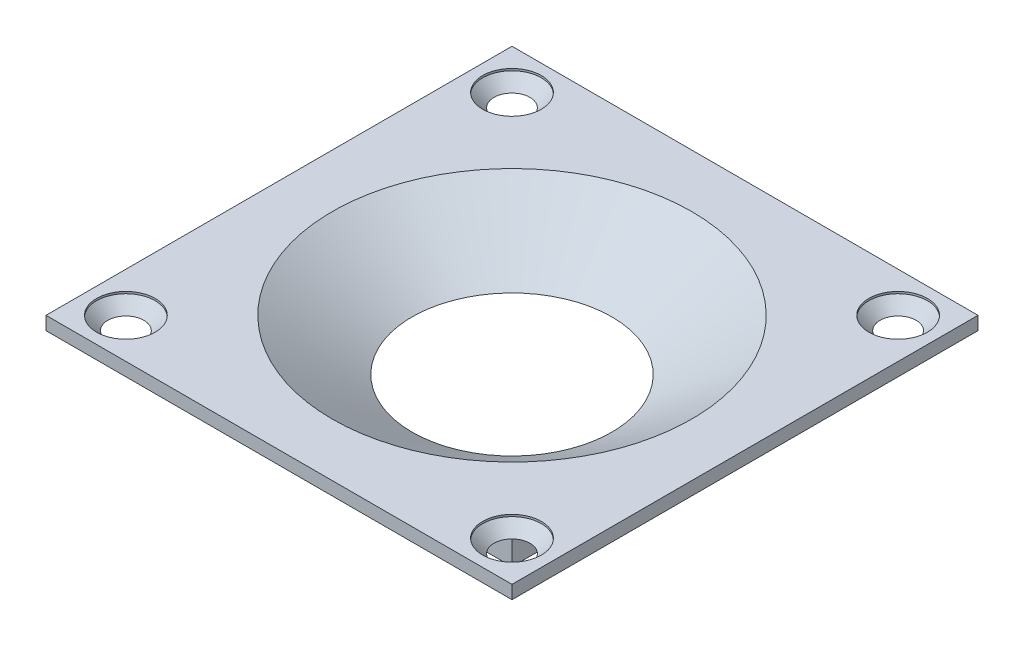
ISO-10303-21;
HEADER;
FILE_DESCRIPTION(('STEP AP214'),'2;1');
FILE_NAME('part.step','',(''),(''),'','','');
FILE_SCHEMA(('AUTOMOTIVE_DESIGN { 1 0 10303 214 1 1 1 1 }'));
ENDSEC;
DATA;
#1=APPLICATION_CONTEXT('core data for automotive mechanical design processes');
#2=APPLICATION_PROTOCOL_DEFINITION('international standard','automotive_design',2000,#1);
#3=PRODUCT_CONTEXT('',#1,'mechanical');
#4=PRODUCT('Part','Part','',(#3));
#5=PRODUCT_RELATED_PRODUCT_CATEGORY('part','',(#4));
#6=PRODUCT_DEFINITION_FORMATION('','',#4);
#7=PRODUCT_DEFINITION_CONTEXT('part definition',#1,'design');
#8=PRODUCT_DEFINITION('design','',#6,#7);
#9=PRODUCT_DEFINITION_SHAPE('','',#8);
#10=(LENGTH_UNIT() NAMED_UNIT(*) SI_UNIT(.MILLI.,.METRE.));
#11=(NAMED_UNIT(*) PLANE_ANGLE_UNIT() SI_UNIT($,.RADIAN.));
#12=(NAMED_UNIT(*) SI_UNIT($,.STERADIAN.) SOLID_ANGLE_UNIT());
#13=UNCERTAINTY_MEASURE_WITH_UNIT(LENGTH_MEASURE(1.E-05),#10,'distance_accuracy_value','');
#14=(GEOMETRIC_REPRESENTATION_CONTEXT(3) GLOBAL_UNCERTAINTY_ASSIGNED_CONTEXT((#13)) GLOBAL_UNIT_ASSIGNED_CONTEXT((#10,
#11,#12)) REPRESENTATION_CONTEXT('',''));
#15=CARTESIAN_POINT('',(0.,0.,0.));
#16=DIRECTION('',(0.,0.,1.));
#17=DIRECTION('',(1.,0.,0.));
#18=AXIS2_PLACEMENT_3D('',#15,#16,#17);
#19=CARTESIAN_POINT('',(12.5,2.85,12.5));
#20=DIRECTION('',(-1.,0.,0.));
#21=DIRECTION('',(0.,0.,1.));
#22=AXIS2_PLACEMENT_3D('',#19,#20,#21);
#23=PLANE('',#22);
#24=DIRECTION('',(0.,0.,-1.));
#25=VECTOR('',#24,1.);
#26=CARTESIAN_POINT('',(12.5,0.,12.5));
#27=LINE('',#26,#25);
#28=CARTESIAN_POINT('',(12.5,0.,12.5));
#29=VERTEX_POINT('',#28);
#30=CARTESIAN_POINT('',(12.5,0.,-12.5));
#31=VERTEX_POINT('',#30);
#32=EDGE_CURVE('E134',#29,#31,#27,.T.);
#33=ORIENTED_EDGE('',*,*,#32,.T.);
#34=DIRECTION('',(0.,-1.,0.));
#35=VECTOR('',#34,1.);
#36=CARTESIAN_POINT('',(12.5,2.85,-12.5));
#37=LINE('',#36,#35);
#38=CARTESIAN_POINT('',(12.5,2.85,-12.5));
#39=VERTEX_POINT('',#38);
#40=EDGE_CURVE('E11',#39,#31,#37,.T.);
#41=ORIENTED_EDGE('',*,*,#40,.F.);
#42=DIRECTION('',(0.,0.,-1.));
#43=VECTOR('',#42,1.);
#44=CARTESIAN_POINT('',(12.5,2.85,12.5));
#45=LINE('',#44,#43);
#46=CARTESIAN_POINT('',(12.5,2.85,12.5));
#47=VERTEX_POINT('',#46);
#48=EDGE_CURVE('E143',#47,#39,#45,.T.);
#49=ORIENTED_EDGE('',*,*,#48,.F.);
#50=DIRECTION('',(0.,-1.,0.));
#51=VECTOR('',#50,1.);
#52=CARTESIAN_POINT('',(12.5,2.85,12.5));
#53=LINE('',#52,#51);
#54=EDGE_CURVE('E152',#47,#29,#53,.T.);
#55=ORIENTED_EDGE('',*,*,#54,.T.);
#56=EDGE_LOOP('',(#33,#41,#49,#55));
#57=FACE_BOUND('',#56,.T.);
#58=ADVANCED_FACE('F34',(#57),#23,.F.);
#59=CARTESIAN_POINT('',(-12.5,2.85,-12.5));
#60=DIRECTION('',(0.,0.,1.));
#61=DIRECTION('',(1.,0.,0.));
#62=AXIS2_PLACEMENT_3D('',#59,#60,#61);
#63=PLANE('',#62);
#64=DIRECTION('',(-1.,0.,0.));
#65=VECTOR('',#64,1.);
#66=CARTESIAN_POINT('',(-12.5,0.,-12.5));
#67=LINE('',#66,#65);
#68=CARTESIAN_POINT('',(-12.5,0.,-12.5));
#69=VERTEX_POINT('',#68);
#70=EDGE_CURVE('E137',#31,#69,#67,.T.);
#71=ORIENTED_EDGE('',*,*,#70,.T.);
#72=DIRECTION('',(0.,-1.,0.));
#73=VECTOR('',#72,1.);
#74=CARTESIAN_POINT('',(-12.5,2.85,-12.5));
#75=LINE('',#74,#73);
#76=CARTESIAN_POINT('',(-12.5,2.85,-12.5));
#77=VERTEX_POINT('',#76);
#78=EDGE_CURVE('E43',#77,#69,#75,.T.);
#79=ORIENTED_EDGE('',*,*,#78,.F.);
#80=DIRECTION('',(-1.,0.,0.));
#81=VECTOR('',#80,1.);
#82=CARTESIAN_POINT('',(-12.5,2.85,-12.5));
#83=LINE('',#82,#81);
#84=EDGE_CURVE('E78',#39,#77,#83,.T.);
#85=ORIENTED_EDGE('',*,*,#84,.F.);
#86=ORIENTED_EDGE('',*,*,#40,.T.);
#87=EDGE_LOOP('',(#71,#79,#85,#86));
#88=FACE_BOUND('',#87,.T.);
#89=ADVANCED_FACE('F226',(#88),#63,.F.);
#90=CARTESIAN_POINT('',(-12.5,2.85,12.5));
#91=DIRECTION('',(1.,0.,0.));
#92=DIRECTION('',(0.,0.,-1.));
#93=AXIS2_PLACEMENT_3D('',#90,#91,#92);
#94=PLANE('',#93);
#95=DIRECTION('',(0.,0.,1.));
#96=VECTOR('',#95,1.);
#97=CARTESIAN_POINT('',(-12.5,0.,12.5));
#98=LINE('',#97,#96);
#99=CARTESIAN_POINT('',(-12.5,0.,12.5));
#100=VERTEX_POINT('',#99);
#101=EDGE_CURVE('E68',#69,#100,#98,.T.);
#102=ORIENTED_EDGE('',*,*,#101,.T.);
#103=DIRECTION('',(0.,-1.,0.));
#104=VECTOR('',#103,1.);
#105=CARTESIAN_POINT('',(-12.5,2.85,12.5));
#106=LINE('',#105,#104);
#107=CARTESIAN_POINT('',(-12.5,2.85,12.5));
#108=VERTEX_POINT('',#107);
#109=EDGE_CURVE('E52',#108,#100,#106,.T.);
#110=ORIENTED_EDGE('',*,*,#109,.F.);
#111=DIRECTION('',(0.,0.,1.));
#112=VECTOR('',#111,1.);
#113=CARTESIAN_POINT('',(-12.5,2.85,12.5));
#114=LINE('',#113,#112);
#115=EDGE_CURVE('E147',#77,#108,#114,.T.);
#116=ORIENTED_EDGE('',*,*,#115,.F.);
#117=ORIENTED_EDGE('',*,*,#78,.T.);
#118=EDGE_LOOP('',(#102,#110,#116,#117));
#119=FACE_BOUND('',#118,.T.);
#120=ADVANCED_FACE('F231',(#119),#94,.F.);
#121=CARTESIAN_POINT('',(-12.5,2.85,12.5));
#122=DIRECTION('',(0.,0.,-1.));
#123=DIRECTION('',(-1.,0.,0.));
#124=AXIS2_PLACEMENT_3D('',#121,#122,#123);
#125=PLANE('',#124);
#126=DIRECTION('',(1.,0.,0.));
#127=VECTOR('',#126,1.);
#128=CARTESIAN_POINT('',(-12.5,0.,12.5));
#129=LINE('',#128,#127);
#130=EDGE_CURVE('E73',#100,#29,#129,.T.);
#131=ORIENTED_EDGE('',*,*,#130,.T.);
#132=ORIENTED_EDGE('',*,*,#54,.F.);
#133=DIRECTION('',(1.,0.,0.));
#134=VECTOR('',#133,1.);
#135=CARTESIAN_POINT('',(-12.5,2.85,12.5));
#136=LINE('',#135,#134);
#137=EDGE_CURVE('E150',#108,#47,#136,.T.);
#138=ORIENTED_EDGE('',*,*,#137,.F.);
#139=ORIENTED_EDGE('',*,*,#109,.T.);
#140=EDGE_LOOP('',(#131,#132,#138,#139));
#141=FACE_BOUND('',#140,.T.);
#142=ADVANCED_FACE('F235',(#141),#125,.F.);
#143=CARTESIAN_POINT('',(0.,0.,0.));
#144=DIRECTION('',(0.,-1.,0.));
#145=DIRECTION('',(0.,0.,-1.));
#146=AXIS2_PLACEMENT_3D('',#143,#144,#145);
#147=PLANE('',#146);
#148=CARTESIAN_POINT('',(0.,0.,0.));
#149=DIRECTION('',(0.,-1.,0.));
#150=DIRECTION('',(0.,0.,-1.));
#151=AXIS2_PLACEMENT_3D('',#148,#149,#150);
#152=CIRCLE('',#151,7.5);
#153=CARTESIAN_POINT('',(0.,0.,-7.5));
#154=VERTEX_POINT('',#153);
#155=EDGE_CURVE('E194',#154,#154,#152,.T.);
#156=ORIENTED_EDGE('',*,*,#155,.F.);
#157=EDGE_LOOP('',(#156));
#158=FACE_BOUND('',#157,.T.);
#159=ORIENTED_EDGE('',*,*,#32,.F.);
#160=ORIENTED_EDGE('',*,*,#130,.F.);
#161=ORIENTED_EDGE('',*,*,#101,.F.);
#162=ORIENTED_EDGE('',*,*,#70,.F.);
#163=EDGE_LOOP('',(#159,#160,#161,#162));
#164=FACE_BOUND('',#163,.T.);
#165=ADVANCED_FACE('F234',(#158,#164),#147,.T.);
#166=CARTESIAN_POINT('',(0.,2.85,0.));
#167=DIRECTION('',(0.,-1.,0.));
#168=DIRECTION('',(0.,0.,-1.));
#169=AXIS2_PLACEMENT_3D('',#166,#167,#168);
#170=PLANE('',#169);
#171=CARTESIAN_POINT('',(-14.5,2.85,-14.5));
#172=DIRECTION('',(0.,-1.,0.));
#173=DIRECTION('',(0.,0.,-1.));
#174=AXIS2_PLACEMENT_3D('',#171,#172,#173);
#175=CIRCLE('',#174,1.35);
#176=CARTESIAN_POINT('',(-14.5,2.85,-15.85));
#177=VERTEX_POINT('',#176);
#178=EDGE_CURVE('E37',#177,#177,#175,.T.);
#179=ORIENTED_EDGE('',*,*,#178,.F.);
#180=EDGE_LOOP('',(#179));
#181=FACE_BOUND('',#180,.T.);
#182=CARTESIAN_POINT('',(14.5,2.85,-14.5));
#183=DIRECTION('',(0.,-1.,0.));
#184=DIRECTION('',(0.,0.,-1.));
#185=AXIS2_PLACEMENT_3D('',#182,#183,#184);
#186=CIRCLE('',#185,1.35);
#187=CARTESIAN_POINT('',(14.5,2.85,-15.85));
#188=VERTEX_POINT('',#187);
#189=EDGE_CURVE('E169',#188,#188,#186,.T.);
#190=ORIENTED_EDGE('',*,*,#189,.F.);
#191=EDGE_LOOP('',(#190));
#192=FACE_BOUND('',#191,.T.);
#193=CARTESIAN_POINT('',(14.5,2.85,14.5));
#194=DIRECTION('',(0.,-1.,0.));
#195=DIRECTION('',(0.,0.,-1.));
#196=AXIS2_PLACEMENT_3D('',#193,#194,#195);
#197=CIRCLE('',#196,1.35);
#198=CARTESIAN_POINT('',(14.5,2.85,13.15));
#199=VERTEX_POINT('',#198);
#200=EDGE_CURVE('E165',#199,#199,#197,.T.);
#201=ORIENTED_EDGE('',*,*,#200,.F.);
#202=EDGE_LOOP('',(#201));
#203=FACE_BOUND('',#202,.T.);
#204=CARTESIAN_POINT('',(-14.5,2.85,14.5));
#205=DIRECTION('',(0.,-1.,0.));
#206=DIRECTION('',(0.,0.,-1.));
#207=AXIS2_PLACEMENT_3D('',#204,#205,#206);
#208=CIRCLE('',#207,1.35);
#209=CARTESIAN_POINT('',(-14.5,2.85,13.15));
#210=VERTEX_POINT('',#209);
#211=EDGE_CURVE('E160',#210,#210,#208,.T.);
#212=ORIENTED_EDGE('',*,*,#211,.F.);
#213=EDGE_LOOP('',(#212));
#214=FACE_BOUND('',#213,.T.);
#215=DIRECTION('',(0.,0.,-1.));
#216=VECTOR('',#215,1.);
#217=CARTESIAN_POINT('',(17.5,2.85,17.5));
#218=LINE('',#217,#216);
#219=CARTESIAN_POINT('',(17.5,2.85,17.5));
#220=VERTEX_POINT('',#219);
#221=CARTESIAN_POINT('',(17.5,2.85,-17.5));
#222=VERTEX_POINT('',#221);
#223=EDGE_CURVE('E133',#220,#222,#218,.T.);
#224=ORIENTED_EDGE('',*,*,#223,.F.);
#225=DIRECTION('',(1.,0.,0.));
#226=VECTOR('',#225,1.);
#227=CARTESIAN_POINT('',(-17.5,2.85,17.5));
#228=LINE('',#227,#226);
#229=CARTESIAN_POINT('',(-17.5,2.85,17.5));
#230=VERTEX_POINT('',#229);
#231=EDGE_CURVE('E129',#230,#220,#228,.T.);
#232=ORIENTED_EDGE('',*,*,#231,.F.);
#233=DIRECTION('',(0.,0.,1.));
#234=VECTOR('',#233,1.);
#235=CARTESIAN_POINT('',(-17.5,2.85,17.5));
#236=LINE('',#235,#234);
#237=CARTESIAN_POINT('',(-17.5,2.85,-17.5));
#238=VERTEX_POINT('',#237);
#239=EDGE_CURVE('E203',#238,#230,#236,.T.);
#240=ORIENTED_EDGE('',*,*,#239,.F.);
#241=DIRECTION('',(-1.,0.,0.));
#242=VECTOR('',#241,1.);
#243=CARTESIAN_POINT('',(-17.5,2.85,-17.5));
#244=LINE('',#243,#242);
#245=EDGE_CURVE('E201',#222,#238,#244,.T.);
#246=ORIENTED_EDGE('',*,*,#245,.F.);
#247=EDGE_LOOP('',(#224,#232,#240,#246));
#248=FACE_BOUND('',#247,.T.);
#249=ORIENTED_EDGE('',*,*,#48,.T.);
#250=ORIENTED_EDGE('',*,*,#84,.T.);
#251=ORIENTED_EDGE('',*,*,#115,.T.);
#252=ORIENTED_EDGE('',*,*,#137,.T.);
#253=EDGE_LOOP('',(#249,#250,#251,#252));
#254=FACE_BOUND('',#253,.T.);
#255=ADVANCED_FACE('F214',(#181,#192,#203,#214,#248,#254),#170,.T.);
#256=CARTESIAN_POINT('',(17.5,3.85,17.5));
#257=DIRECTION('',(-1.,0.,0.));
#258=DIRECTION('',(0.,0.,1.));
#259=AXIS2_PLACEMENT_3D('',#256,#257,#258);
#260=PLANE('',#259);
#261=ORIENTED_EDGE('',*,*,#223,.T.);
#262=DIRECTION('',(0.,-1.,0.));
#263=VECTOR('',#262,1.);
#264=CARTESIAN_POINT('',(17.5,3.85,-17.5));
#265=LINE('',#264,#263);
#266=CARTESIAN_POINT('',(17.5,3.85,-17.5));
#267=VERTEX_POINT('',#266);
#268=EDGE_CURVE('E113',#267,#222,#265,.T.);
#269=ORIENTED_EDGE('',*,*,#268,.F.);
#270=DIRECTION('',(0.,0.,-1.));
#271=VECTOR('',#270,1.);
#272=CARTESIAN_POINT('',(17.5,3.85,17.5));
#273=LINE('',#272,#271);
#274=CARTESIAN_POINT('',(17.5,3.85,17.5));
#275=VERTEX_POINT('',#274);
#276=EDGE_CURVE('E120',#275,#267,#273,.T.);
#277=ORIENTED_EDGE('',*,*,#276,.F.);
#278=DIRECTION('',(0.,-1.,0.));
#279=VECTOR('',#278,1.);
#280=CARTESIAN_POINT('',(17.5,3.85,17.5));
#281=LINE('',#280,#279);
#282=EDGE_CURVE('E199',#275,#220,#281,.T.);
#283=ORIENTED_EDGE('',*,*,#282,.T.);
#284=EDGE_LOOP('',(#261,#269,#277,#283));
#285=FACE_BOUND('',#284,.T.);
#286=ADVANCED_FACE('F131',(#285),#260,.F.);
#287=CARTESIAN_POINT('',(-17.5,3.85,-17.5));
#288=DIRECTION('',(0.,0.,1.));
#289=DIRECTION('',(1.,0.,0.));
#290=AXIS2_PLACEMENT_3D('',#287,#288,#289);
#291=PLANE('',#290);
#292=ORIENTED_EDGE('',*,*,#245,.T.);
#293=DIRECTION('',(0.,-1.,0.));
#294=VECTOR('',#293,1.);
#295=CARTESIAN_POINT('',(-17.5,3.85,-17.5));
#296=LINE('',#295,#294);
#297=CARTESIAN_POINT('',(-17.5,3.85,-17.5));
#298=VERTEX_POINT('',#297);
#299=EDGE_CURVE('E116',#298,#238,#296,.T.);
#300=ORIENTED_EDGE('',*,*,#299,.F.);
#301=DIRECTION('',(-1.,0.,0.));
#302=VECTOR('',#301,1.);
#303=CARTESIAN_POINT('',(-17.5,3.85,-17.5));
#304=LINE('',#303,#302);
#305=EDGE_CURVE('E109',#267,#298,#304,.T.);
#306=ORIENTED_EDGE('',*,*,#305,.F.);
#307=ORIENTED_EDGE('',*,*,#268,.T.);
#308=EDGE_LOOP('',(#292,#300,#306,#307));
#309=FACE_BOUND('',#308,.T.);
#310=ADVANCED_FACE('F111',(#309),#291,.F.);
#311=CARTESIAN_POINT('',(-17.5,3.85,17.5));
#312=DIRECTION('',(1.,0.,0.));
#313=DIRECTION('',(0.,0.,-1.));
#314=AXIS2_PLACEMENT_3D('',#311,#312,#313);
#315=PLANE('',#314);
#316=ORIENTED_EDGE('',*,*,#239,.T.);
#317=DIRECTION('',(0.,-1.,0.));
#318=VECTOR('',#317,1.);
#319=CARTESIAN_POINT('',(-17.5,3.85,17.5));
#320=LINE('',#319,#318);
#321=CARTESIAN_POINT('',(-17.5,3.85,17.5));
#322=VERTEX_POINT('',#321);
#323=EDGE_CURVE('E139',#322,#230,#320,.T.);
#324=ORIENTED_EDGE('',*,*,#323,.F.);
#325=DIRECTION('',(0.,0.,1.));
#326=VECTOR('',#325,1.);
#327=CARTESIAN_POINT('',(-17.5,3.85,17.5));
#328=LINE('',#327,#326);
#329=EDGE_CURVE('E119',#298,#322,#328,.T.);
#330=ORIENTED_EDGE('',*,*,#329,.F.);
#331=ORIENTED_EDGE('',*,*,#299,.T.);
#332=EDGE_LOOP('',(#316,#324,#330,#331));
#333=FACE_BOUND('',#332,.T.);
#334=ADVANCED_FACE('F216',(#333),#315,.F.);
#335=CARTESIAN_POINT('',(-17.5,3.85,17.5));
#336=DIRECTION('',(0.,0.,-1.));
#337=DIRECTION('',(-1.,0.,0.));
#338=AXIS2_PLACEMENT_3D('',#335,#336,#337);
#339=PLANE('',#338);
#340=ORIENTED_EDGE('',*,*,#231,.T.);
#341=ORIENTED_EDGE('',*,*,#282,.F.);
#342=DIRECTION('',(1.,0.,0.));
#343=VECTOR('',#342,1.);
#344=CARTESIAN_POINT('',(-17.5,3.85,17.5));
#345=LINE('',#344,#343);
#346=EDGE_CURVE('E125',#322,#275,#345,.T.);
#347=ORIENTED_EDGE('',*,*,#346,.F.);
#348=ORIENTED_EDGE('',*,*,#323,.T.);
#349=EDGE_LOOP('',(#340,#341,#347,#348));
#350=FACE_BOUND('',#349,.T.);
#351=ADVANCED_FACE('F210',(#350),#339,.F.);
#352=CARTESIAN_POINT('',(0.,3.85,0.));
#353=DIRECTION('',(0.,-1.,0.));
#354=DIRECTION('',(0.,0.,-1.));
#355=AXIS2_PLACEMENT_3D('',#352,#353,#354);
#356=PLANE('',#355);
#357=CARTESIAN_POINT('',(-14.5,3.85,-14.5));
#358=DIRECTION('',(0.,1.,0.));
#359=DIRECTION('',(0.,0.,1.));
#360=AXIS2_PLACEMENT_3D('',#357,#358,#359);
#361=CIRCLE('',#360,2.2);
#362=CARTESIAN_POINT('',(-14.5,3.85,-12.3));
#363=VERTEX_POINT('',#362);
#364=EDGE_CURVE('E303',#363,#363,#361,.T.);
#365=ORIENTED_EDGE('',*,*,#364,.F.);
#366=EDGE_LOOP('',(#365));
#367=FACE_BOUND('',#366,.T.);
#368=CARTESIAN_POINT('',(14.5,3.85,-14.5));
#369=DIRECTION('',(0.,1.,0.));
#370=DIRECTION('',(0.,0.,1.));
#371=AXIS2_PLACEMENT_3D('',#368,#369,#370);
#372=CIRCLE('',#371,2.2);
#373=CARTESIAN_POINT('',(14.5,3.85,-12.3));
#374=VERTEX_POINT('',#373);
#375=EDGE_CURVE('E178',#374,#374,#372,.T.);
#376=ORIENTED_EDGE('',*,*,#375,.F.);
#377=EDGE_LOOP('',(#376));
#378=FACE_BOUND('',#377,.T.);
#379=CARTESIAN_POINT('',(14.5,3.85,14.5));
#380=DIRECTION('',(0.,1.,0.));
#381=DIRECTION('',(0.,0.,1.));
#382=AXIS2_PLACEMENT_3D('',#379,#380,#381);
#383=CIRCLE('',#382,2.2);
#384=CARTESIAN_POINT('',(14.5,3.85,16.7));
#385=VERTEX_POINT('',#384);
#386=EDGE_CURVE('E171',#385,#385,#383,.T.);
#387=ORIENTED_EDGE('',*,*,#386,.F.);
#388=EDGE_LOOP('',(#387));
#389=FACE_BOUND('',#388,.T.);
#390=CARTESIAN_POINT('',(-14.5,3.85,14.5));
#391=DIRECTION('',(0.,1.,0.));
#392=DIRECTION('',(0.,0.,1.));
#393=AXIS2_PLACEMENT_3D('',#390,#391,#392);
#394=CIRCLE('',#393,2.2);
#395=CARTESIAN_POINT('',(-14.5,3.85,16.7));
#396=VERTEX_POINT('',#395);
#397=EDGE_CURVE('E167',#396,#396,#394,.T.);
#398=ORIENTED_EDGE('',*,*,#397,.F.);
#399=EDGE_LOOP('',(#398));
#400=FACE_BOUND('',#399,.T.);
#401=CARTESIAN_POINT('',(0.,3.85,0.));
#402=DIRECTION('',(0.,-1.,0.));
#403=DIRECTION('',(0.,0.,-1.));
#404=AXIS2_PLACEMENT_3D('',#401,#402,#403);
#405=CIRCLE('',#404,13.5);
#406=CARTESIAN_POINT('',(0.,3.85,-13.5));
#407=VERTEX_POINT('',#406);
#408=EDGE_CURVE('E163',#407,#407,#405,.T.);
#409=ORIENTED_EDGE('',*,*,#408,.T.);
#410=EDGE_LOOP('',(#409));
#411=FACE_BOUND('',#410,.T.);
#412=ORIENTED_EDGE('',*,*,#276,.T.);
#413=ORIENTED_EDGE('',*,*,#305,.T.);
#414=ORIENTED_EDGE('',*,*,#329,.T.);
#415=ORIENTED_EDGE('',*,*,#346,.T.);
#416=EDGE_LOOP('',(#412,#413,#414,#415));
#417=FACE_BOUND('',#416,.T.);
#418=ADVANCED_FACE('F123',(#367,#378,#389,#400,#411,#417),#356,.F.);
#419=CARTESIAN_POINT('',(0.,0.,0.));
#420=DIRECTION('',(0.,1.,0.));
#421=DIRECTION('',(0.,0.,1.));
#422=AXIS2_PLACEMENT_3D('',#419,#420,#421);
#423=CONICAL_SURFACE('',#422,7.5,1.00030166176382);
#424=ORIENTED_EDGE('',*,*,#408,.F.);
#425=EDGE_LOOP('',(#424));
#426=FACE_BOUND('',#425,.T.);
#427=ORIENTED_EDGE('',*,*,#155,.T.);
#428=EDGE_LOOP('',(#427));
#429=FACE_BOUND('',#428,.T.);
#430=ADVANCED_FACE('F260',(#426,#429),#423,.F.);
#431=CARTESIAN_POINT('',(-14.5,3.7,14.5));
#432=DIRECTION('',(0.,1.,0.));
#433=DIRECTION('',(0.,0.,1.));
#434=AXIS2_PLACEMENT_3D('',#431,#432,#433);
#435=CONICAL_SURFACE('',#434,2.2,0.785398163397448);
#436=ORIENTED_EDGE('',*,*,#211,.T.);
#437=EDGE_LOOP('',(#436));
#438=FACE_BOUND('',#437,.T.);
#439=CARTESIAN_POINT('',(-14.5,3.7,14.5));
#440=DIRECTION('',(0.,1.,0.));
#441=DIRECTION('',(0.,0.,1.));
#442=AXIS2_PLACEMENT_3D('',#439,#440,#441);
#443=CIRCLE('',#442,2.2);
#444=CARTESIAN_POINT('',(-14.5,3.7,16.7));
#445=VERTEX_POINT('',#444);
#446=EDGE_CURVE('E164',#445,#445,#443,.T.);
#447=ORIENTED_EDGE('',*,*,#446,.T.);
#448=EDGE_LOOP('',(#447));
#449=FACE_BOUND('',#448,.T.);
#450=ADVANCED_FACE('F264',(#438,#449),#435,.F.);
#451=CARTESIAN_POINT('',(-14.5,3.85,14.5));
#452=DIRECTION('',(0.,1.,0.));
#453=DIRECTION('',(0.,0.,1.));
#454=AXIS2_PLACEMENT_3D('',#451,#452,#453);
#455=CYLINDRICAL_SURFACE('',#454,2.2);
#456=ORIENTED_EDGE('',*,*,#446,.F.);
#457=EDGE_LOOP('',(#456));
#458=FACE_BOUND('',#457,.T.);
#459=ORIENTED_EDGE('',*,*,#397,.T.);
#460=EDGE_LOOP('',(#459));
#461=FACE_BOUND('',#460,.T.);
#462=ADVANCED_FACE('F268',(#458,#461),#455,.F.);
#463=CARTESIAN_POINT('',(14.5,3.7,14.5));
#464=DIRECTION('',(0.,1.,0.));
#465=DIRECTION('',(0.,0.,1.));
#466=AXIS2_PLACEMENT_3D('',#463,#464,#465);
#467=CONICAL_SURFACE('',#466,2.2,0.785398163397449);
#468=ORIENTED_EDGE('',*,*,#200,.T.);
#469=EDGE_LOOP('',(#468));
#470=FACE_BOUND('',#469,.T.);
#471=CARTESIAN_POINT('',(14.5,3.7,14.5));
#472=DIRECTION('',(0.,1.,0.));
#473=DIRECTION('',(0.,0.,1.));
#474=AXIS2_PLACEMENT_3D('',#471,#472,#473);
#475=CIRCLE('',#474,2.2);
#476=CARTESIAN_POINT('',(14.5,3.7,16.7));
#477=VERTEX_POINT('',#476);
#478=EDGE_CURVE('E168',#477,#477,#475,.T.);
#479=ORIENTED_EDGE('',*,*,#478,.T.);
#480=EDGE_LOOP('',(#479));
#481=FACE_BOUND('',#480,.T.);
#482=ADVANCED_FACE('F272',(#470,#481),#467,.F.);
#483=CARTESIAN_POINT('',(14.5,3.85,14.5));
#484=DIRECTION('',(0.,1.,0.));
#485=DIRECTION('',(0.,0.,1.));
#486=AXIS2_PLACEMENT_3D('',#483,#484,#485);
#487=CYLINDRICAL_SURFACE('',#486,2.2);
#488=ORIENTED_EDGE('',*,*,#478,.F.);
#489=EDGE_LOOP('',(#488));
#490=FACE_BOUND('',#489,.T.);
#491=ORIENTED_EDGE('',*,*,#386,.T.);
#492=EDGE_LOOP('',(#491));
#493=FACE_BOUND('',#492,.T.);
#494=ADVANCED_FACE('F276',(#490,#493),#487,.F.);
#495=CARTESIAN_POINT('',(14.5,3.7,-14.5));
#496=DIRECTION('',(0.,1.,0.));
#497=DIRECTION('',(0.,0.,1.));
#498=AXIS2_PLACEMENT_3D('',#495,#496,#497);
#499=CONICAL_SURFACE('',#498,2.2,0.785398163397447);
#500=ORIENTED_EDGE('',*,*,#189,.T.);
#501=EDGE_LOOP('',(#500));
#502=FACE_BOUND('',#501,.T.);
#503=CARTESIAN_POINT('',(14.5,3.7,-14.5));
#504=DIRECTION('',(0.,1.,0.));
#505=DIRECTION('',(0.,0.,1.));
#506=AXIS2_PLACEMENT_3D('',#503,#504,#505);
#507=CIRCLE('',#506,2.2);
#508=CARTESIAN_POINT('',(14.5,3.7,-12.3));
#509=VERTEX_POINT('',#508);
#510=EDGE_CURVE('E172',#509,#509,#507,.T.);
#511=ORIENTED_EDGE('',*,*,#510,.T.);
#512=EDGE_LOOP('',(#511));
#513=FACE_BOUND('',#512,.T.);
#514=ADVANCED_FACE('F280',(#502,#513),#499,.F.);
#515=CARTESIAN_POINT('',(14.5,3.85,-14.5));
#516=DIRECTION('',(0.,1.,0.));
#517=DIRECTION('',(0.,0.,1.));
#518=AXIS2_PLACEMENT_3D('',#515,#516,#517);
#519=CYLINDRICAL_SURFACE('',#518,2.2);
#520=ORIENTED_EDGE('',*,*,#510,.F.);
#521=EDGE_LOOP('',(#520));
#522=FACE_BOUND('',#521,.T.);
#523=ORIENTED_EDGE('',*,*,#375,.T.);
#524=EDGE_LOOP('',(#523));
#525=FACE_BOUND('',#524,.T.);
#526=ADVANCED_FACE('F284',(#522,#525),#519,.F.);
#527=CARTESIAN_POINT('',(-14.5,3.7,-14.5));
#528=DIRECTION('',(0.,1.,0.));
#529=DIRECTION('',(0.,0.,1.));
#530=AXIS2_PLACEMENT_3D('',#527,#528,#529);
#531=CONICAL_SURFACE('',#530,2.2,0.785398163397448);
#532=ORIENTED_EDGE('',*,*,#178,.T.);
#533=EDGE_LOOP('',(#532));
#534=FACE_BOUND('',#533,.T.);
#535=CARTESIAN_POINT('',(-14.5,3.7,-14.5));
#536=DIRECTION('',(0.,1.,0.));
#537=DIRECTION('',(0.,0.,1.));
#538=AXIS2_PLACEMENT_3D('',#535,#536,#537);
#539=CIRCLE('',#538,2.2);
#540=CARTESIAN_POINT('',(-14.5,3.7,-12.3));
#541=VERTEX_POINT('',#540);
#542=EDGE_CURVE('E300',#541,#541,#539,.T.);
#543=ORIENTED_EDGE('',*,*,#542,.T.);
#544=EDGE_LOOP('',(#543));
#545=FACE_BOUND('',#544,.T.);
#546=ADVANCED_FACE('F287',(#534,#545),#531,.F.);
#547=CARTESIAN_POINT('',(-14.5,3.85,-14.5));
#548=DIRECTION('',(0.,1.,0.));
#549=DIRECTION('',(0.,0.,1.));
#550=AXIS2_PLACEMENT_3D('',#547,#548,#549);
#551=CYLINDRICAL_SURFACE('',#550,2.2);
#552=ORIENTED_EDGE('',*,*,#542,.F.);
#553=EDGE_LOOP('',(#552));
#554=FACE_BOUND('',#553,.T.);
#555=ORIENTED_EDGE('',*,*,#364,.T.);
#556=EDGE_LOOP('',(#555));
#557=FACE_BOUND('',#556,.T.);
#558=ADVANCED_FACE('F291',(#554,#557),#551,.F.);
#559=CLOSED_SHELL('',(#58,#89,#120,#142,#165,#255,#286,#310,#334,#351,#418,#430,#450,#462,#482,
#494,#514,#526,#546,#558));
#560=MANIFOLD_SOLID_BREP('B2',#559);
#561=ADVANCED_BREP_SHAPE_REPRESENTATION('',(#18,#560),#14);
#562=SHAPE_DEFINITION_REPRESENTATION(#9,#561);
ENDSEC;
END-ISO-10303-21;
